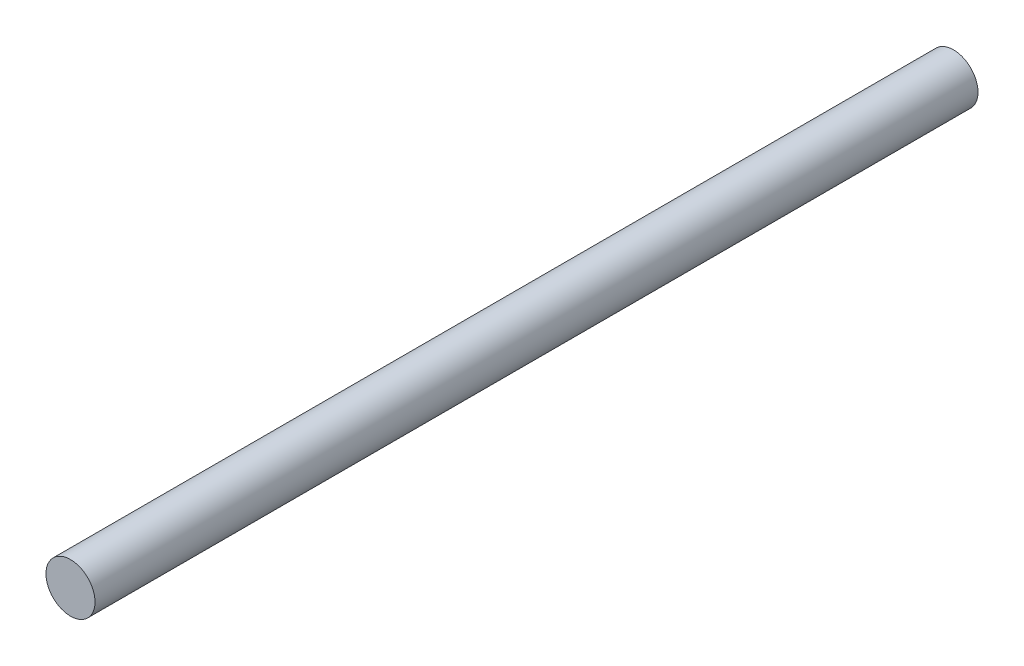
ISO-10303-21;
HEADER;
FILE_DESCRIPTION(('STEP AP214'),'2;1');
FILE_NAME('part.step','',(''),(''),'','','');
FILE_SCHEMA(('AUTOMOTIVE_DESIGN { 1 0 10303 214 1 1 1 1 }'));
ENDSEC;
DATA;
#1=APPLICATION_CONTEXT('core data for automotive mechanical design processes');
#2=APPLICATION_PROTOCOL_DEFINITION('international standard','automotive_design',2000,#1);
#3=PRODUCT_CONTEXT('',#1,'mechanical');
#4=PRODUCT('Part','Part','',(#3));
#5=PRODUCT_RELATED_PRODUCT_CATEGORY('part','',(#4));
#6=PRODUCT_DEFINITION_FORMATION('','',#4);
#7=PRODUCT_DEFINITION_CONTEXT('part definition',#1,'design');
#8=PRODUCT_DEFINITION('design','',#6,#7);
#9=PRODUCT_DEFINITION_SHAPE('','',#8);
#10=(LENGTH_UNIT() NAMED_UNIT(*) SI_UNIT(.MILLI.,.METRE.));
#11=(NAMED_UNIT(*) PLANE_ANGLE_UNIT() SI_UNIT($,.RADIAN.));
#12=(NAMED_UNIT(*) SI_UNIT($,.STERADIAN.) SOLID_ANGLE_UNIT());
#13=UNCERTAINTY_MEASURE_WITH_UNIT(LENGTH_MEASURE(1.E-05),#10,'distance_accuracy_value','');
#14=(GEOMETRIC_REPRESENTATION_CONTEXT(3) GLOBAL_UNCERTAINTY_ASSIGNED_CONTEXT((#13)) GLOBAL_UNIT_ASSIGNED_CONTEXT((#10,
#11,#12)) REPRESENTATION_CONTEXT('',''));
#15=CARTESIAN_POINT('',(0.,0.,0.));
#16=DIRECTION('',(0.,0.,1.));
#17=DIRECTION('',(1.,0.,0.));
#18=AXIS2_PLACEMENT_3D('',#15,#16,#17);
#19=CARTESIAN_POINT('',(0.,0.,457.2));
#20=DIRECTION('',(0.,0.,-1.));
#21=DIRECTION('',(-1.,0.,0.));
#22=AXIS2_PLACEMENT_3D('',#19,#20,#21);
#23=CYLINDRICAL_SURFACE('',#22,25.4);
#24=CARTESIAN_POINT('',(0.,0.,457.2));
#25=DIRECTION('',(0.,0.,1.));
#26=DIRECTION('',(1.,0.,0.));
#27=AXIS2_PLACEMENT_3D('',#24,#25,#26);
#28=CIRCLE('',#27,25.4);
#29=CARTESIAN_POINT('',(25.4,0.,457.2));
#30=VERTEX_POINT('',#29);
#31=EDGE_CURVE('E10',#30,#30,#28,.T.);
#32=ORIENTED_EDGE('',*,*,#31,.F.);
#33=EDGE_LOOP('',(#32));
#34=FACE_BOUND('',#33,.T.);
#35=CARTESIAN_POINT('',(0.,0.,-457.2));
#36=DIRECTION('',(0.,0.,1.));
#37=DIRECTION('',(1.,0.,0.));
#38=AXIS2_PLACEMENT_3D('',#35,#36,#37);
#39=CIRCLE('',#38,25.4);
#40=CARTESIAN_POINT('',(25.4,0.,-457.2));
#41=VERTEX_POINT('',#40);
#42=EDGE_CURVE('E40',#41,#41,#39,.T.);
#43=ORIENTED_EDGE('',*,*,#42,.T.);
#44=EDGE_LOOP('',(#43));
#45=FACE_BOUND('',#44,.T.);
#46=ADVANCED_FACE('F34',(#34,#45),#23,.T.);
#47=CARTESIAN_POINT('',(0.,0.,457.2));
#48=DIRECTION('',(0.,0.,1.));
#49=DIRECTION('',(1.,0.,0.));
#50=AXIS2_PLACEMENT_3D('',#47,#48,#49);
#51=PLANE('',#50);
#52=ORIENTED_EDGE('',*,*,#31,.T.);
#53=EDGE_LOOP('',(#52));
#54=FACE_BOUND('',#53,.T.);
#55=ADVANCED_FACE('F49',(#54),#51,.T.);
#56=CARTESIAN_POINT('',(0.,0.,-457.2));
#57=DIRECTION('',(0.,0.,1.));
#58=DIRECTION('',(1.,0.,0.));
#59=AXIS2_PLACEMENT_3D('',#56,#57,#58);
#60=PLANE('',#59);
#61=ORIENTED_EDGE('',*,*,#42,.F.);
#62=EDGE_LOOP('',(#61));
#63=FACE_BOUND('',#62,.T.);
#64=ADVANCED_FACE('F47',(#63),#60,.F.);
#65=CLOSED_SHELL('',(#46,#55,#64));
#66=MANIFOLD_SOLID_BREP('B2',#65);
#67=ADVANCED_BREP_SHAPE_REPRESENTATION('',(#18,#66),#14);
#68=SHAPE_DEFINITION_REPRESENTATION(#9,#67);
ENDSEC;
END-ISO-10303-21;
